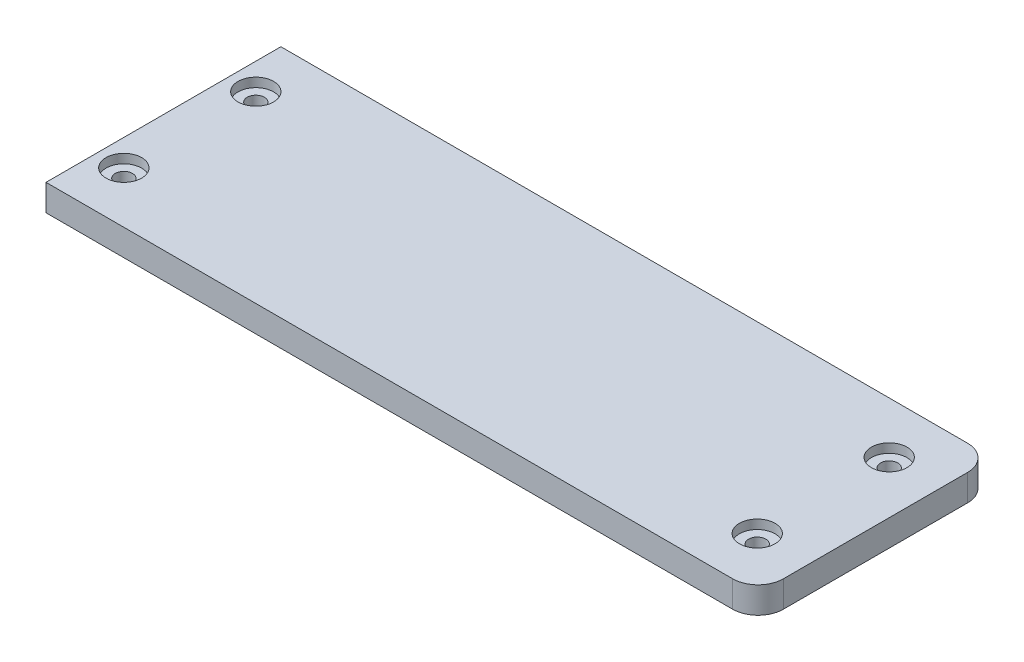
ISO-10303-21;
HEADER;
FILE_DESCRIPTION(('STEP AP214'),'2;1');
FILE_NAME('part.step','',(''),(''),'','','');
FILE_SCHEMA(('AUTOMOTIVE_DESIGN { 1 0 10303 214 1 1 1 1 }'));
ENDSEC;
DATA;
#1=APPLICATION_CONTEXT('core data for automotive mechanical design processes');
#2=APPLICATION_PROTOCOL_DEFINITION('international standard','automotive_design',2000,#1);
#3=PRODUCT_CONTEXT('',#1,'mechanical');
#4=PRODUCT('Part','Part','',(#3));
#5=PRODUCT_RELATED_PRODUCT_CATEGORY('part','',(#4));
#6=PRODUCT_DEFINITION_FORMATION('','',#4);
#7=PRODUCT_DEFINITION_CONTEXT('part definition',#1,'design');
#8=PRODUCT_DEFINITION('design','',#6,#7);
#9=PRODUCT_DEFINITION_SHAPE('','',#8);
#10=(LENGTH_UNIT() NAMED_UNIT(*) SI_UNIT(.MILLI.,.METRE.));
#11=(NAMED_UNIT(*) PLANE_ANGLE_UNIT() SI_UNIT($,.RADIAN.));
#12=(NAMED_UNIT(*) SI_UNIT($,.STERADIAN.) SOLID_ANGLE_UNIT());
#13=UNCERTAINTY_MEASURE_WITH_UNIT(LENGTH_MEASURE(1.E-05),#10,'distance_accuracy_value','');
#14=(GEOMETRIC_REPRESENTATION_CONTEXT(3) GLOBAL_UNCERTAINTY_ASSIGNED_CONTEXT((#13)) GLOBAL_UNIT_ASSIGNED_CONTEXT((#10,
#11,#12)) REPRESENTATION_CONTEXT('',''));
#15=CARTESIAN_POINT('',(0.,0.,0.));
#16=DIRECTION('',(0.,0.,1.));
#17=DIRECTION('',(1.,0.,0.));
#18=AXIS2_PLACEMENT_3D('',#15,#16,#17);
#19=CARTESIAN_POINT('',(-66.269993870038,5.,-28.7688953883079));
#20=DIRECTION('',(1.,0.,0.));
#21=DIRECTION('',(0.,0.,-1.));
#22=AXIS2_PLACEMENT_3D('',#19,#20,#21);
#23=PLANE('',#22);
#24=DIRECTION('',(0.,0.,1.));
#25=VECTOR('',#24,1.);
#26=CARTESIAN_POINT('',(-66.269993870038,0.,-28.7688953883079));
#27=LINE('',#26,#25);
#28=CARTESIAN_POINT('',(-66.269993870038,0.,-28.7688953883079));
#29=VERTEX_POINT('',#28);
#30=CARTESIAN_POINT('',(-66.269993870038,0.,15.7311046116921));
#31=VERTEX_POINT('',#30);
#32=EDGE_CURVE('E206',#29,#31,#27,.T.);
#33=ORIENTED_EDGE('',*,*,#32,.T.);
#34=DIRECTION('',(0.,-1.,0.));
#35=VECTOR('',#34,1.);
#36=CARTESIAN_POINT('',(-66.269993870038,5.,15.7311046116921));
#37=LINE('',#36,#35);
#38=CARTESIAN_POINT('',(-66.269993870038,5.,15.7311046116921));
#39=VERTEX_POINT('',#38);
#40=EDGE_CURVE('E11',#39,#31,#37,.T.);
#41=ORIENTED_EDGE('',*,*,#40,.F.);
#42=DIRECTION('',(0.,0.,1.));
#43=VECTOR('',#42,1.);
#44=CARTESIAN_POINT('',(-66.269993870038,5.,-28.7688953883079));
#45=LINE('',#44,#43);
#46=CARTESIAN_POINT('',(-66.269993870038,5.,-28.7688953883079));
#47=VERTEX_POINT('',#46);
#48=EDGE_CURVE('E207',#47,#39,#45,.T.);
#49=ORIENTED_EDGE('',*,*,#48,.F.);
#50=DIRECTION('',(0.,-1.,0.));
#51=VECTOR('',#50,1.);
#52=CARTESIAN_POINT('',(-66.269993870038,5.,-28.7688953883079));
#53=LINE('',#52,#51);
#54=EDGE_CURVE('E48',#47,#29,#53,.T.);
#55=ORIENTED_EDGE('',*,*,#54,.T.);
#56=EDGE_LOOP('',(#33,#41,#49,#55));
#57=FACE_BOUND('',#56,.T.);
#58=ADVANCED_FACE('F39',(#57),#23,.F.);
#59=CARTESIAN_POINT('',(-66.269993870038,5.,15.7311046116921));
#60=DIRECTION('',(0.,0.,-1.));
#61=DIRECTION('',(-1.,0.,0.));
#62=AXIS2_PLACEMENT_3D('',#59,#60,#61);
#63=PLANE('',#62);
#64=DIRECTION('',(1.,0.,0.));
#65=VECTOR('',#64,1.);
#66=CARTESIAN_POINT('',(-66.269993870038,0.,15.7311046116921));
#67=LINE('',#66,#65);
#68=CARTESIAN_POINT('',(63.830006129962,0.,15.7311046116921));
#69=VERTEX_POINT('',#68);
#70=EDGE_CURVE('E68',#31,#69,#67,.T.);
#71=ORIENTED_EDGE('',*,*,#70,.T.);
#72=DIRECTION('',(0.,1.,0.));
#73=VECTOR('',#72,1.);
#74=CARTESIAN_POINT('',(63.830006129962,0.,15.7311046116921));
#75=LINE('',#74,#73);
#76=CARTESIAN_POINT('',(63.830006129962,5.,15.7311046116921));
#77=VERTEX_POINT('',#76);
#78=EDGE_CURVE('E113',#69,#77,#75,.T.);
#79=ORIENTED_EDGE('',*,*,#78,.T.);
#80=DIRECTION('',(1.,0.,0.));
#81=VECTOR('',#80,1.);
#82=CARTESIAN_POINT('',(-66.269993870038,5.,15.7311046116921));
#83=LINE('',#82,#81);
#84=EDGE_CURVE('E210',#39,#77,#83,.T.);
#85=ORIENTED_EDGE('',*,*,#84,.F.);
#86=ORIENTED_EDGE('',*,*,#40,.T.);
#87=EDGE_LOOP('',(#71,#79,#85,#86));
#88=FACE_BOUND('',#87,.T.);
#89=ADVANCED_FACE('F231',(#88),#63,.F.);
#90=CARTESIAN_POINT('',(-66.269993870038,5.,-28.7688953883079));
#91=DIRECTION('',(0.,0.,1.));
#92=DIRECTION('',(1.,0.,0.));
#93=AXIS2_PLACEMENT_3D('',#90,#91,#92);
#94=PLANE('',#93);
#95=DIRECTION('',(-1.,0.,0.));
#96=VECTOR('',#95,1.);
#97=CARTESIAN_POINT('',(-66.269993870038,0.,-28.7688953883079));
#98=LINE('',#97,#96);
#99=CARTESIAN_POINT('',(63.830006129962,0.,-28.7688953883079));
#100=VERTEX_POINT('',#99);
#101=EDGE_CURVE('E74',#100,#29,#98,.T.);
#102=ORIENTED_EDGE('',*,*,#101,.T.);
#103=ORIENTED_EDGE('',*,*,#54,.F.);
#104=DIRECTION('',(-1.,0.,0.));
#105=VECTOR('',#104,1.);
#106=CARTESIAN_POINT('',(-66.269993870038,5.,-28.7688953883079));
#107=LINE('',#106,#105);
#108=CARTESIAN_POINT('',(63.830006129962,5.,-28.7688953883079));
#109=VERTEX_POINT('',#108);
#110=EDGE_CURVE('E56',#109,#47,#107,.T.);
#111=ORIENTED_EDGE('',*,*,#110,.F.);
#112=DIRECTION('',(0.,1.,0.));
#113=VECTOR('',#112,1.);
#114=CARTESIAN_POINT('',(63.830006129962,0.,-28.7688953883079));
#115=LINE('',#114,#113);
#116=EDGE_CURVE('E135',#100,#109,#115,.T.);
#117=ORIENTED_EDGE('',*,*,#116,.F.);
#118=EDGE_LOOP('',(#102,#103,#111,#117));
#119=FACE_BOUND('',#118,.T.);
#120=ADVANCED_FACE('F226',(#119),#94,.F.);
#121=CARTESIAN_POINT('',(0.,5.,0.));
#122=DIRECTION('',(0.,1.,0.));
#123=DIRECTION('',(0.,0.,1.));
#124=AXIS2_PLACEMENT_3D('',#121,#122,#123);
#125=PLANE('',#124);
#126=CARTESIAN_POINT('',(-61.269993870038,5.,-19.0188953883079));
#127=DIRECTION('',(0.,1.,0.));
#128=DIRECTION('',(0.,0.,1.));
#129=AXIS2_PLACEMENT_3D('',#126,#127,#128);
#130=CIRCLE('',#129,3.37312);
#131=CARTESIAN_POINT('',(-61.269993870038,5.,-15.6457753883079));
#132=VERTEX_POINT('',#131);
#133=EDGE_CURVE('E138',#132,#132,#130,.T.);
#134=ORIENTED_EDGE('',*,*,#133,.F.);
#135=EDGE_LOOP('',(#134));
#136=FACE_BOUND('',#135,.T.);
#137=CARTESIAN_POINT('',(-61.269993870038,5.,5.9811046116921));
#138=DIRECTION('',(0.,1.,0.));
#139=DIRECTION('',(0.,0.,1.));
#140=AXIS2_PLACEMENT_3D('',#137,#138,#139);
#141=CIRCLE('',#140,3.37312);
#142=CARTESIAN_POINT('',(-61.269993870038,5.,9.3542246116921));
#143=VERTEX_POINT('',#142);
#144=EDGE_CURVE('E158',#143,#143,#141,.T.);
#145=ORIENTED_EDGE('',*,*,#144,.F.);
#146=EDGE_LOOP('',(#145));
#147=FACE_BOUND('',#146,.T.);
#148=CARTESIAN_POINT('',(58.730006129962,5.,5.98110461169208));
#149=DIRECTION('',(0.,1.,0.));
#150=DIRECTION('',(0.,0.,1.));
#151=AXIS2_PLACEMENT_3D('',#148,#149,#150);
#152=CIRCLE('',#151,3.37312);
#153=CARTESIAN_POINT('',(58.730006129962,5.,9.35422461169208));
#154=VERTEX_POINT('',#153);
#155=EDGE_CURVE('E174',#154,#154,#152,.T.);
#156=ORIENTED_EDGE('',*,*,#155,.F.);
#157=EDGE_LOOP('',(#156));
#158=FACE_BOUND('',#157,.T.);
#159=CARTESIAN_POINT('',(58.730006129962,5.,-19.0188953883079));
#160=DIRECTION('',(0.,1.,0.));
#161=DIRECTION('',(0.,0.,1.));
#162=AXIS2_PLACEMENT_3D('',#159,#160,#161);
#163=CIRCLE('',#162,3.37312);
#164=CARTESIAN_POINT('',(58.730006129962,5.,-15.6457753883079));
#165=VERTEX_POINT('',#164);
#166=EDGE_CURVE('E190',#165,#165,#163,.T.);
#167=ORIENTED_EDGE('',*,*,#166,.F.);
#168=EDGE_LOOP('',(#167));
#169=FACE_BOUND('',#168,.T.);
#170=ORIENTED_EDGE('',*,*,#48,.T.);
#171=ORIENTED_EDGE('',*,*,#84,.T.);
#172=CARTESIAN_POINT('',(63.830006129962,5.,10.9311046116921));
#173=DIRECTION('',(0.,1.,0.));
#174=DIRECTION('',(0.,0.,1.));
#175=AXIS2_PLACEMENT_3D('',#172,#173,#174);
#176=CIRCLE('',#175,4.8);
#177=CARTESIAN_POINT('',(68.630006129962,5.,10.931104611692));
#178=VERTEX_POINT('',#177);
#179=EDGE_CURVE('E130',#77,#178,#176,.T.);
#180=ORIENTED_EDGE('',*,*,#179,.T.);
#181=DIRECTION('',(0.,0.,-1.));
#182=VECTOR('',#181,1.);
#183=CARTESIAN_POINT('',(68.630006129962,5.,-23.9688953883079));
#184=LINE('',#183,#182);
#185=CARTESIAN_POINT('',(68.630006129962,5.,-23.9688953883079));
#186=VERTEX_POINT('',#185);
#187=EDGE_CURVE('E106',#178,#186,#184,.T.);
#188=ORIENTED_EDGE('',*,*,#187,.T.);
#189=CARTESIAN_POINT('',(63.830006129962,5.,-23.9688953883079));
#190=DIRECTION('',(0.,1.,0.));
#191=DIRECTION('',(0.,0.,-1.));
#192=AXIS2_PLACEMENT_3D('',#189,#190,#191);
#193=CIRCLE('',#192,4.8);
#194=EDGE_CURVE('E123',#186,#109,#193,.T.);
#195=ORIENTED_EDGE('',*,*,#194,.T.);
#196=ORIENTED_EDGE('',*,*,#110,.T.);
#197=EDGE_LOOP('',(#170,#171,#180,#188,#195,#196));
#198=FACE_BOUND('',#197,.T.);
#199=ADVANCED_FACE('F230',(#136,#147,#158,#169,#198),#125,.T.);
#200=CARTESIAN_POINT('',(0.,0.,0.));
#201=DIRECTION('',(0.,1.,0.));
#202=DIRECTION('',(0.,0.,1.));
#203=AXIS2_PLACEMENT_3D('',#200,#201,#202);
#204=PLANE('',#203);
#205=CARTESIAN_POINT('',(-61.269993870038,0.,-19.0188953883079));
#206=DIRECTION('',(0.,1.,0.));
#207=DIRECTION('',(0.,0.,1.));
#208=AXIS2_PLACEMENT_3D('',#205,#206,#207);
#209=CIRCLE('',#208,1.63195);
#210=CARTESIAN_POINT('',(-61.269993870038,0.,-17.3869453883079));
#211=VERTEX_POINT('',#210);
#212=EDGE_CURVE('E154',#211,#211,#209,.T.);
#213=ORIENTED_EDGE('',*,*,#212,.T.);
#214=EDGE_LOOP('',(#213));
#215=FACE_BOUND('',#214,.T.);
#216=CARTESIAN_POINT('',(-61.269993870038,0.,5.9811046116921));
#217=DIRECTION('',(0.,1.,0.));
#218=DIRECTION('',(0.,0.,1.));
#219=AXIS2_PLACEMENT_3D('',#216,#217,#218);
#220=CIRCLE('',#219,1.63195);
#221=CARTESIAN_POINT('',(-61.269993870038,0.,7.6130546116921));
#222=VERTEX_POINT('',#221);
#223=EDGE_CURVE('E170',#222,#222,#220,.T.);
#224=ORIENTED_EDGE('',*,*,#223,.T.);
#225=EDGE_LOOP('',(#224));
#226=FACE_BOUND('',#225,.T.);
#227=CARTESIAN_POINT('',(58.730006129962,0.,5.98110461169208));
#228=DIRECTION('',(0.,1.,0.));
#229=DIRECTION('',(0.,0.,1.));
#230=AXIS2_PLACEMENT_3D('',#227,#228,#229);
#231=CIRCLE('',#230,1.63195);
#232=CARTESIAN_POINT('',(58.730006129962,0.,7.61305461169208));
#233=VERTEX_POINT('',#232);
#234=EDGE_CURVE('E186',#233,#233,#231,.T.);
#235=ORIENTED_EDGE('',*,*,#234,.T.);
#236=EDGE_LOOP('',(#235));
#237=FACE_BOUND('',#236,.T.);
#238=CARTESIAN_POINT('',(58.730006129962,0.,-19.0188953883079));
#239=DIRECTION('',(0.,1.,0.));
#240=DIRECTION('',(0.,0.,1.));
#241=AXIS2_PLACEMENT_3D('',#238,#239,#240);
#242=CIRCLE('',#241,1.63195);
#243=CARTESIAN_POINT('',(58.730006129962,0.,-17.3869453883079));
#244=VERTEX_POINT('',#243);
#245=EDGE_CURVE('E202',#244,#244,#242,.T.);
#246=ORIENTED_EDGE('',*,*,#245,.T.);
#247=EDGE_LOOP('',(#246));
#248=FACE_BOUND('',#247,.T.);
#249=ORIENTED_EDGE('',*,*,#32,.F.);
#250=ORIENTED_EDGE('',*,*,#101,.F.);
#251=CARTESIAN_POINT('',(63.830006129962,0.,-23.9688953883079));
#252=DIRECTION('',(0.,1.,0.));
#253=DIRECTION('',(0.,0.,-1.));
#254=AXIS2_PLACEMENT_3D('',#251,#252,#253);
#255=CIRCLE('',#254,4.8);
#256=CARTESIAN_POINT('',(68.630006129962,0.,-23.9688953883079));
#257=VERTEX_POINT('',#256);
#258=EDGE_CURVE('E118',#257,#100,#255,.T.);
#259=ORIENTED_EDGE('',*,*,#258,.F.);
#260=DIRECTION('',(0.,0.,-1.));
#261=VECTOR('',#260,1.);
#262=CARTESIAN_POINT('',(68.630006129962,0.,-23.9688953883079));
#263=LINE('',#262,#261);
#264=CARTESIAN_POINT('',(68.630006129962,0.,10.931104611692));
#265=VERTEX_POINT('',#264);
#266=EDGE_CURVE('E104',#265,#257,#263,.T.);
#267=ORIENTED_EDGE('',*,*,#266,.F.);
#268=CARTESIAN_POINT('',(63.830006129962,0.,10.9311046116921));
#269=DIRECTION('',(0.,1.,0.));
#270=DIRECTION('',(0.,0.,1.));
#271=AXIS2_PLACEMENT_3D('',#268,#269,#270);
#272=CIRCLE('',#271,4.8);
#273=EDGE_CURVE('E116',#69,#265,#272,.T.);
#274=ORIENTED_EDGE('',*,*,#273,.F.);
#275=ORIENTED_EDGE('',*,*,#70,.F.);
#276=EDGE_LOOP('',(#249,#250,#259,#267,#274,#275));
#277=FACE_BOUND('',#276,.T.);
#278=ADVANCED_FACE('F115',(#215,#226,#237,#248,#277),#204,.F.);
#279=CARTESIAN_POINT('',(58.730006129962,5.,-19.0188953883079));
#280=DIRECTION('',(0.,1.,0.));
#281=DIRECTION('',(0.,0.,1.));
#282=AXIS2_PLACEMENT_3D('',#279,#280,#281);
#283=CYLINDRICAL_SURFACE('',#282,1.63195);
#284=ORIENTED_EDGE('',*,*,#245,.F.);
#285=EDGE_LOOP('',(#284));
#286=FACE_BOUND('',#285,.T.);
#287=CARTESIAN_POINT('',(58.730006129962,3.2728,-19.0188953883079));
#288=DIRECTION('',(0.,1.,0.));
#289=DIRECTION('',(0.,0.,1.));
#290=AXIS2_PLACEMENT_3D('',#287,#288,#289);
#291=CIRCLE('',#290,1.63195);
#292=CARTESIAN_POINT('',(58.730006129962,3.2728,-17.3869453883079));
#293=VERTEX_POINT('',#292);
#294=EDGE_CURVE('E198',#293,#293,#291,.T.);
#295=ORIENTED_EDGE('',*,*,#294,.T.);
#296=EDGE_LOOP('',(#295));
#297=FACE_BOUND('',#296,.T.);
#298=ADVANCED_FACE('F242',(#286,#297),#283,.F.);
#299=CARTESIAN_POINT('',(60.361956129962,3.2728,-19.0188953883079));
#300=DIRECTION('',(0.,-1.,0.));
#301=DIRECTION('',(0.,0.,-1.));
#302=AXIS2_PLACEMENT_3D('',#299,#300,#301);
#303=PLANE('',#302);
#304=ORIENTED_EDGE('',*,*,#294,.F.);
#305=EDGE_LOOP('',(#304));
#306=FACE_BOUND('',#305,.T.);
#307=CARTESIAN_POINT('',(58.730006129962,3.2728,-19.0188953883079));
#308=DIRECTION('',(0.,1.,0.));
#309=DIRECTION('',(0.,0.,1.));
#310=AXIS2_PLACEMENT_3D('',#307,#308,#309);
#311=CIRCLE('',#310,3.37312);
#312=CARTESIAN_POINT('',(58.730006129962,3.2728,-15.6457753883079));
#313=VERTEX_POINT('',#312);
#314=EDGE_CURVE('E194',#313,#313,#311,.T.);
#315=ORIENTED_EDGE('',*,*,#314,.T.);
#316=EDGE_LOOP('',(#315));
#317=FACE_BOUND('',#316,.T.);
#318=ADVANCED_FACE('F249',(#306,#317),#303,.F.);
#319=CARTESIAN_POINT('',(58.730006129962,5.,-19.0188953883079));
#320=DIRECTION('',(0.,1.,0.));
#321=DIRECTION('',(0.,0.,1.));
#322=AXIS2_PLACEMENT_3D('',#319,#320,#321);
#323=CYLINDRICAL_SURFACE('',#322,3.37312);
#324=ORIENTED_EDGE('',*,*,#314,.F.);
#325=EDGE_LOOP('',(#324));
#326=FACE_BOUND('',#325,.T.);
#327=ORIENTED_EDGE('',*,*,#166,.T.);
#328=EDGE_LOOP('',(#327));
#329=FACE_BOUND('',#328,.T.);
#330=ADVANCED_FACE('F253',(#326,#329),#323,.F.);
#331=CARTESIAN_POINT('',(58.730006129962,5.,5.98110461169208));
#332=DIRECTION('',(0.,1.,0.));
#333=DIRECTION('',(0.,0.,1.));
#334=AXIS2_PLACEMENT_3D('',#331,#332,#333);
#335=CYLINDRICAL_SURFACE('',#334,1.63195);
#336=ORIENTED_EDGE('',*,*,#234,.F.);
#337=EDGE_LOOP('',(#336));
#338=FACE_BOUND('',#337,.T.);
#339=CARTESIAN_POINT('',(58.730006129962,3.2728,5.98110461169208));
#340=DIRECTION('',(0.,1.,0.));
#341=DIRECTION('',(0.,0.,1.));
#342=AXIS2_PLACEMENT_3D('',#339,#340,#341);
#343=CIRCLE('',#342,1.63195);
#344=CARTESIAN_POINT('',(58.730006129962,3.2728,7.61305461169208));
#345=VERTEX_POINT('',#344);
#346=EDGE_CURVE('E182',#345,#345,#343,.T.);
#347=ORIENTED_EDGE('',*,*,#346,.T.);
#348=EDGE_LOOP('',(#347));
#349=FACE_BOUND('',#348,.T.);
#350=ADVANCED_FACE('F257',(#338,#349),#335,.F.);
#351=CARTESIAN_POINT('',(60.361956129962,3.2728,5.98110461169208));
#352=DIRECTION('',(0.,-1.,0.));
#353=DIRECTION('',(0.,0.,-1.));
#354=AXIS2_PLACEMENT_3D('',#351,#352,#353);
#355=PLANE('',#354);
#356=ORIENTED_EDGE('',*,*,#346,.F.);
#357=EDGE_LOOP('',(#356));
#358=FACE_BOUND('',#357,.T.);
#359=CARTESIAN_POINT('',(58.730006129962,3.2728,5.98110461169208));
#360=DIRECTION('',(0.,1.,0.));
#361=DIRECTION('',(0.,0.,1.));
#362=AXIS2_PLACEMENT_3D('',#359,#360,#361);
#363=CIRCLE('',#362,3.37312);
#364=CARTESIAN_POINT('',(58.730006129962,3.2728,9.35422461169208));
#365=VERTEX_POINT('',#364);
#366=EDGE_CURVE('E178',#365,#365,#363,.T.);
#367=ORIENTED_EDGE('',*,*,#366,.T.);
#368=EDGE_LOOP('',(#367));
#369=FACE_BOUND('',#368,.T.);
#370=ADVANCED_FACE('F261',(#358,#369),#355,.F.);
#371=CARTESIAN_POINT('',(58.730006129962,5.,5.98110461169208));
#372=DIRECTION('',(0.,1.,0.));
#373=DIRECTION('',(0.,0.,1.));
#374=AXIS2_PLACEMENT_3D('',#371,#372,#373);
#375=CYLINDRICAL_SURFACE('',#374,3.37312);
#376=ORIENTED_EDGE('',*,*,#366,.F.);
#377=EDGE_LOOP('',(#376));
#378=FACE_BOUND('',#377,.T.);
#379=ORIENTED_EDGE('',*,*,#155,.T.);
#380=EDGE_LOOP('',(#379));
#381=FACE_BOUND('',#380,.T.);
#382=ADVANCED_FACE('F265',(#378,#381),#375,.F.);
#383=CARTESIAN_POINT('',(-61.269993870038,5.,5.9811046116921));
#384=DIRECTION('',(0.,1.,0.));
#385=DIRECTION('',(0.,0.,1.));
#386=AXIS2_PLACEMENT_3D('',#383,#384,#385);
#387=CYLINDRICAL_SURFACE('',#386,1.63195);
#388=ORIENTED_EDGE('',*,*,#223,.F.);
#389=EDGE_LOOP('',(#388));
#390=FACE_BOUND('',#389,.T.);
#391=CARTESIAN_POINT('',(-61.269993870038,3.2728,5.9811046116921));
#392=DIRECTION('',(0.,1.,0.));
#393=DIRECTION('',(0.,0.,1.));
#394=AXIS2_PLACEMENT_3D('',#391,#392,#393);
#395=CIRCLE('',#394,1.63195);
#396=CARTESIAN_POINT('',(-61.269993870038,3.2728,7.6130546116921));
#397=VERTEX_POINT('',#396);
#398=EDGE_CURVE('E166',#397,#397,#395,.T.);
#399=ORIENTED_EDGE('',*,*,#398,.T.);
#400=EDGE_LOOP('',(#399));
#401=FACE_BOUND('',#400,.T.);
#402=ADVANCED_FACE('F269',(#390,#401),#387,.F.);
#403=CARTESIAN_POINT('',(-59.638043870038,3.2728,5.9811046116921));
#404=DIRECTION('',(0.,-1.,0.));
#405=DIRECTION('',(0.,0.,-1.));
#406=AXIS2_PLACEMENT_3D('',#403,#404,#405);
#407=PLANE('',#406);
#408=ORIENTED_EDGE('',*,*,#398,.F.);
#409=EDGE_LOOP('',(#408));
#410=FACE_BOUND('',#409,.T.);
#411=CARTESIAN_POINT('',(-61.269993870038,3.2728,5.9811046116921));
#412=DIRECTION('',(0.,1.,0.));
#413=DIRECTION('',(0.,0.,1.));
#414=AXIS2_PLACEMENT_3D('',#411,#412,#413);
#415=CIRCLE('',#414,3.37312);
#416=CARTESIAN_POINT('',(-61.269993870038,3.2728,9.3542246116921));
#417=VERTEX_POINT('',#416);
#418=EDGE_CURVE('E162',#417,#417,#415,.T.);
#419=ORIENTED_EDGE('',*,*,#418,.T.);
#420=EDGE_LOOP('',(#419));
#421=FACE_BOUND('',#420,.T.);
#422=ADVANCED_FACE('F273',(#410,#421),#407,.F.);
#423=CARTESIAN_POINT('',(-61.269993870038,5.,5.9811046116921));
#424=DIRECTION('',(0.,1.,0.));
#425=DIRECTION('',(0.,0.,1.));
#426=AXIS2_PLACEMENT_3D('',#423,#424,#425);
#427=CYLINDRICAL_SURFACE('',#426,3.37312);
#428=ORIENTED_EDGE('',*,*,#418,.F.);
#429=EDGE_LOOP('',(#428));
#430=FACE_BOUND('',#429,.T.);
#431=ORIENTED_EDGE('',*,*,#144,.T.);
#432=EDGE_LOOP('',(#431));
#433=FACE_BOUND('',#432,.T.);
#434=ADVANCED_FACE('F277',(#430,#433),#427,.F.);
#435=CARTESIAN_POINT('',(-61.269993870038,5.,-19.0188953883079));
#436=DIRECTION('',(0.,1.,0.));
#437=DIRECTION('',(0.,0.,1.));
#438=AXIS2_PLACEMENT_3D('',#435,#436,#437);
#439=CYLINDRICAL_SURFACE('',#438,1.63195);
#440=ORIENTED_EDGE('',*,*,#212,.F.);
#441=EDGE_LOOP('',(#440));
#442=FACE_BOUND('',#441,.T.);
#443=CARTESIAN_POINT('',(-61.269993870038,3.2728,-19.0188953883079));
#444=DIRECTION('',(0.,1.,0.));
#445=DIRECTION('',(0.,0.,1.));
#446=AXIS2_PLACEMENT_3D('',#443,#444,#445);
#447=CIRCLE('',#446,1.63195);
#448=CARTESIAN_POINT('',(-61.269993870038,3.2728,-17.3869453883079));
#449=VERTEX_POINT('',#448);
#450=EDGE_CURVE('E150',#449,#449,#447,.T.);
#451=ORIENTED_EDGE('',*,*,#450,.T.);
#452=EDGE_LOOP('',(#451));
#453=FACE_BOUND('',#452,.T.);
#454=ADVANCED_FACE('F281',(#442,#453),#439,.F.);
#455=CARTESIAN_POINT('',(-59.638043870038,3.2728,-19.0188953883079));
#456=DIRECTION('',(0.,-1.,0.));
#457=DIRECTION('',(0.,0.,-1.));
#458=AXIS2_PLACEMENT_3D('',#455,#456,#457);
#459=PLANE('',#458);
#460=ORIENTED_EDGE('',*,*,#450,.F.);
#461=EDGE_LOOP('',(#460));
#462=FACE_BOUND('',#461,.T.);
#463=CARTESIAN_POINT('',(-61.269993870038,3.2728,-19.0188953883079));
#464=DIRECTION('',(0.,1.,0.));
#465=DIRECTION('',(0.,0.,1.));
#466=AXIS2_PLACEMENT_3D('',#463,#464,#465);
#467=CIRCLE('',#466,3.37312);
#468=CARTESIAN_POINT('',(-61.269993870038,3.2728,-15.6457753883079));
#469=VERTEX_POINT('',#468);
#470=EDGE_CURVE('E146',#469,#469,#467,.T.);
#471=ORIENTED_EDGE('',*,*,#470,.T.);
#472=EDGE_LOOP('',(#471));
#473=FACE_BOUND('',#472,.T.);
#474=ADVANCED_FACE('F285',(#462,#473),#459,.F.);
#475=CARTESIAN_POINT('',(-61.269993870038,5.,-19.0188953883079));
#476=DIRECTION('',(0.,1.,0.));
#477=DIRECTION('',(0.,0.,1.));
#478=AXIS2_PLACEMENT_3D('',#475,#476,#477);
#479=CYLINDRICAL_SURFACE('',#478,3.37312);
#480=ORIENTED_EDGE('',*,*,#470,.F.);
#481=EDGE_LOOP('',(#480));
#482=FACE_BOUND('',#481,.T.);
#483=ORIENTED_EDGE('',*,*,#133,.T.);
#484=EDGE_LOOP('',(#483));
#485=FACE_BOUND('',#484,.T.);
#486=ADVANCED_FACE('F289',(#482,#485),#479,.F.);
#487=CARTESIAN_POINT('',(63.830006129962,0.,-23.9688953883079));
#488=DIRECTION('',(0.,1.,0.));
#489=DIRECTION('',(0.,0.,1.));
#490=AXIS2_PLACEMENT_3D('',#487,#488,#489);
#491=CYLINDRICAL_SURFACE('',#490,4.8);
#492=ORIENTED_EDGE('',*,*,#194,.F.);
#493=DIRECTION('',(0.,1.,0.));
#494=VECTOR('',#493,1.);
#495=CARTESIAN_POINT('',(68.630006129962,0.,-23.9688953883079));
#496=LINE('',#495,#494);
#497=EDGE_CURVE('E112',#257,#186,#496,.T.);
#498=ORIENTED_EDGE('',*,*,#497,.F.);
#499=ORIENTED_EDGE('',*,*,#258,.T.);
#500=ORIENTED_EDGE('',*,*,#116,.T.);
#501=EDGE_LOOP('',(#492,#498,#499,#500));
#502=FACE_BOUND('',#501,.T.);
#503=ADVANCED_FACE('F229',(#502),#491,.T.);
#504=CARTESIAN_POINT('',(68.630006129962,0.,-23.9688953883079));
#505=DIRECTION('',(1.,0.,0.));
#506=DIRECTION('',(0.,0.,-1.));
#507=AXIS2_PLACEMENT_3D('',#504,#505,#506);
#508=PLANE('',#507);
#509=ORIENTED_EDGE('',*,*,#187,.F.);
#510=DIRECTION('',(0.,1.,0.));
#511=VECTOR('',#510,1.);
#512=CARTESIAN_POINT('',(68.630006129962,0.,10.931104611692));
#513=LINE('',#512,#511);
#514=EDGE_CURVE('E101',#265,#178,#513,.T.);
#515=ORIENTED_EDGE('',*,*,#514,.F.);
#516=ORIENTED_EDGE('',*,*,#266,.T.);
#517=ORIENTED_EDGE('',*,*,#497,.T.);
#518=EDGE_LOOP('',(#509,#515,#516,#517));
#519=FACE_BOUND('',#518,.T.);
#520=ADVANCED_FACE('F103',(#519),#508,.T.);
#521=CARTESIAN_POINT('',(63.830006129962,0.,10.9311046116921));
#522=DIRECTION('',(0.,1.,0.));
#523=DIRECTION('',(0.,0.,1.));
#524=AXIS2_PLACEMENT_3D('',#521,#522,#523);
#525=CYLINDRICAL_SURFACE('',#524,4.8);
#526=ORIENTED_EDGE('',*,*,#179,.F.);
#527=ORIENTED_EDGE('',*,*,#78,.F.);
#528=ORIENTED_EDGE('',*,*,#273,.T.);
#529=ORIENTED_EDGE('',*,*,#514,.T.);
#530=EDGE_LOOP('',(#526,#527,#528,#529));
#531=FACE_BOUND('',#530,.T.);
#532=ADVANCED_FACE('F121',(#531),#525,.T.);
#533=CLOSED_SHELL('',(#58,#89,#120,#199,#278,#298,#318,#330,#350,#370,#382,#402,#422,#434,#454,
#474,#486,#503,#520,#532));
#534=MANIFOLD_SOLID_BREP('B2',#533);
#535=ADVANCED_BREP_SHAPE_REPRESENTATION('',(#18,#534),#14);
#536=SHAPE_DEFINITION_REPRESENTATION(#9,#535);
ENDSEC;
END-ISO-10303-21;
